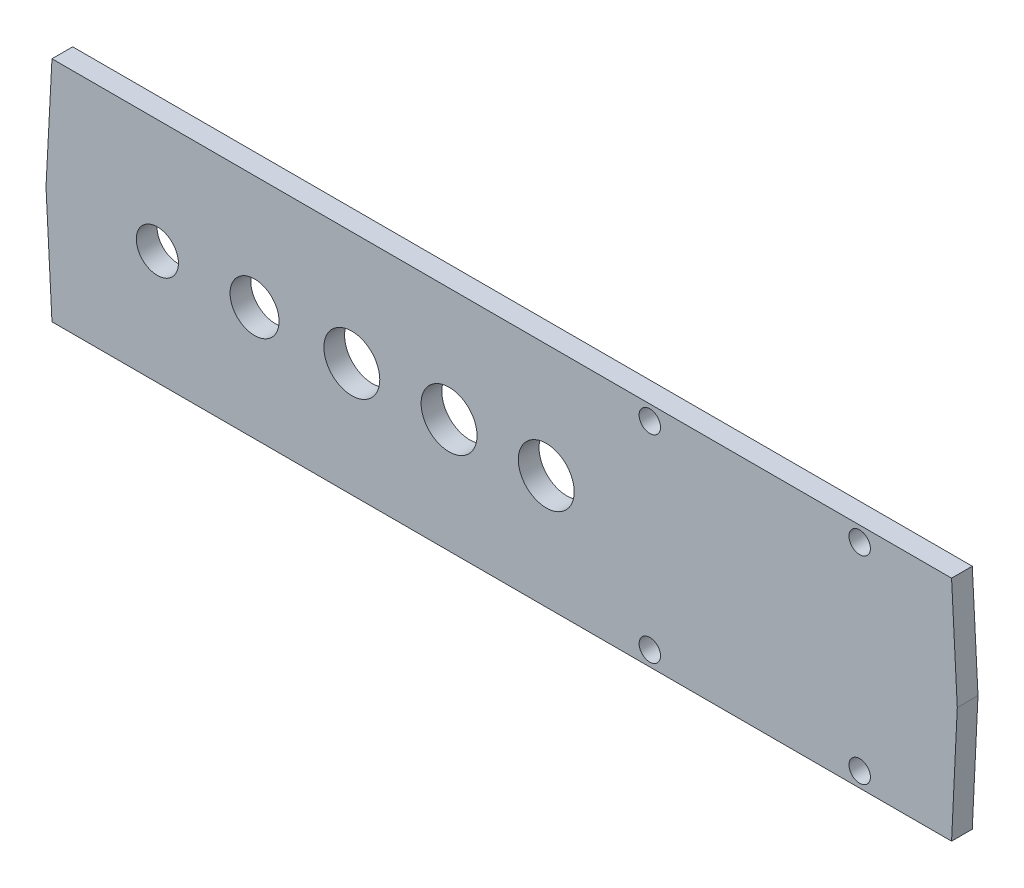
ISO-10303-21;
HEADER;
FILE_DESCRIPTION(('STEP AP214'),'2;1');
FILE_NAME('part.step','',(''),(''),'','','');
FILE_SCHEMA(('AUTOMOTIVE_DESIGN { 1 0 10303 214 1 1 1 1 }'));
ENDSEC;
DATA;
#1=APPLICATION_CONTEXT('core data for automotive mechanical design processes');
#2=APPLICATION_PROTOCOL_DEFINITION('international standard','automotive_design',2000,#1);
#3=PRODUCT_CONTEXT('',#1,'mechanical');
#4=PRODUCT('Part','Part','',(#3));
#5=PRODUCT_RELATED_PRODUCT_CATEGORY('part','',(#4));
#6=PRODUCT_DEFINITION_FORMATION('','',#4);
#7=PRODUCT_DEFINITION_CONTEXT('part definition',#1,'design');
#8=PRODUCT_DEFINITION('design','',#6,#7);
#9=PRODUCT_DEFINITION_SHAPE('','',#8);
#10=(LENGTH_UNIT() NAMED_UNIT(*) SI_UNIT(.MILLI.,.METRE.));
#11=(NAMED_UNIT(*) PLANE_ANGLE_UNIT() SI_UNIT($,.RADIAN.));
#12=(NAMED_UNIT(*) SI_UNIT($,.STERADIAN.) SOLID_ANGLE_UNIT());
#13=UNCERTAINTY_MEASURE_WITH_UNIT(LENGTH_MEASURE(1.E-05),#10,'distance_accuracy_value','');
#14=(GEOMETRIC_REPRESENTATION_CONTEXT(3) GLOBAL_UNCERTAINTY_ASSIGNED_CONTEXT((#13)) GLOBAL_UNIT_ASSIGNED_CONTEXT((#10,
#11,#12)) REPRESENTATION_CONTEXT('',''));
#15=CARTESIAN_POINT('',(0.,0.,0.));
#16=DIRECTION('',(0.,0.,1.));
#17=DIRECTION('',(1.,0.,0.));
#18=AXIS2_PLACEMENT_3D('',#15,#16,#17);
#19=CARTESIAN_POINT('',(0.,0.,3.));
#20=DIRECTION('',(0.998629534754574,-0.0523359562429475,0.));
#21=DIRECTION('',(0.0523359562429476,0.998629534754574,0.));
#22=AXIS2_PLACEMENT_3D('',#19,#20,#21);
#23=PLANE('',#22);
#24=DIRECTION('',(-0.0523359562429475,-0.998629534754574,0.));
#25=VECTOR('',#24,1.);
#26=CARTESIAN_POINT('',(0.,0.,0.));
#27=LINE('',#26,#25);
#28=CARTESIAN_POINT('',(0.,0.,0.));
#29=VERTEX_POINT('',#28);
#30=CARTESIAN_POINT('',(-0.864729170174011,-16.5000154939549,0.));
#31=VERTEX_POINT('',#30);
#32=EDGE_CURVE('E130',#29,#31,#27,.T.);
#33=ORIENTED_EDGE('',*,*,#32,.T.);
#34=DIRECTION('',(0.,0.,-1.));
#35=VECTOR('',#34,1.);
#36=CARTESIAN_POINT('',(-0.864729170174011,-16.5000154939549,3.));
#37=LINE('',#36,#35);
#38=CARTESIAN_POINT('',(-0.864729170174011,-16.5000154939549,3.));
#39=VERTEX_POINT('',#38);
#40=EDGE_CURVE('E11',#39,#31,#37,.T.);
#41=ORIENTED_EDGE('',*,*,#40,.F.);
#42=DIRECTION('',(-0.0523359562429475,-0.998629534754574,0.));
#43=VECTOR('',#42,1.);
#44=CARTESIAN_POINT('',(0.,0.,3.));
#45=LINE('',#44,#43);
#46=CARTESIAN_POINT('',(0.,0.,3.));
#47=VERTEX_POINT('',#46);
#48=EDGE_CURVE('E146',#47,#39,#45,.T.);
#49=ORIENTED_EDGE('',*,*,#48,.F.);
#50=DIRECTION('',(0.,0.,-1.));
#51=VECTOR('',#50,1.);
#52=CARTESIAN_POINT('',(0.,0.,3.));
#53=LINE('',#52,#51);
#54=EDGE_CURVE('E126',#47,#29,#53,.T.);
#55=ORIENTED_EDGE('',*,*,#54,.T.);
#56=EDGE_LOOP('',(#33,#41,#49,#55));
#57=FACE_BOUND('',#56,.T.);
#58=ADVANCED_FACE('F39',(#57),#23,.F.);
#59=CARTESIAN_POINT('',(0.,-33.0000309879097,3.));
#60=DIRECTION('',(0.998629534754574,0.0523359562429479,0.));
#61=DIRECTION('',(-0.0523359562429479,0.998629534754574,0.));
#62=AXIS2_PLACEMENT_3D('',#59,#60,#61);
#63=PLANE('',#62);
#64=DIRECTION('',(0.0523359562429479,-0.998629534754574,0.));
#65=VECTOR('',#64,1.);
#66=CARTESIAN_POINT('',(0.,-33.0000309879097,0.));
#67=LINE('',#66,#65);
#68=CARTESIAN_POINT('',(0.,-33.0000309879097,0.));
#69=VERTEX_POINT('',#68);
#70=EDGE_CURVE('E134',#31,#69,#67,.T.);
#71=ORIENTED_EDGE('',*,*,#70,.T.);
#72=DIRECTION('',(0.,0.,-1.));
#73=VECTOR('',#72,1.);
#74=CARTESIAN_POINT('',(0.,-33.0000309879097,3.));
#75=LINE('',#74,#73);
#76=CARTESIAN_POINT('',(0.,-33.0000309879097,3.));
#77=VERTEX_POINT('',#76);
#78=EDGE_CURVE('E49',#77,#69,#75,.T.);
#79=ORIENTED_EDGE('',*,*,#78,.F.);
#80=DIRECTION('',(0.0523359562429479,-0.998629534754574,0.));
#81=VECTOR('',#80,1.);
#82=CARTESIAN_POINT('',(0.,-33.0000309879097,3.));
#83=LINE('',#82,#81);
#84=EDGE_CURVE('E95',#39,#77,#83,.T.);
#85=ORIENTED_EDGE('',*,*,#84,.F.);
#86=ORIENTED_EDGE('',*,*,#40,.T.);
#87=EDGE_LOOP('',(#71,#79,#85,#86));
#88=FACE_BOUND('',#87,.T.);
#89=ADVANCED_FACE('F209',(#88),#63,.F.);
#90=CARTESIAN_POINT('',(130.305174389268,-32.9999924717593,3.));
#91=DIRECTION('',(-2.95584198131817E-07,0.999999999999956,0.));
#92=DIRECTION('',(-0.999999999999956,-2.95584198131817E-07,0.));
#93=AXIS2_PLACEMENT_3D('',#90,#91,#92);
#94=PLANE('',#93);
#95=DIRECTION('',(0.999999999999956,2.95584198131817E-07,0.));
#96=VECTOR('',#95,1.);
#97=CARTESIAN_POINT('',(130.305174389268,-32.9999924717593,0.));
#98=LINE('',#97,#96);
#99=CARTESIAN_POINT('',(130.305174389268,-32.9999924717593,0.));
#100=VERTEX_POINT('',#99);
#101=EDGE_CURVE('E137',#69,#100,#98,.T.);
#102=ORIENTED_EDGE('',*,*,#101,.T.);
#103=DIRECTION('',(0.,0.,-1.));
#104=VECTOR('',#103,1.);
#105=CARTESIAN_POINT('',(130.305174389268,-32.9999924717593,3.));
#106=LINE('',#105,#104);
#107=CARTESIAN_POINT('',(130.305174389268,-32.9999924717593,3.));
#108=VERTEX_POINT('',#107);
#109=EDGE_CURVE('E119',#108,#100,#106,.T.);
#110=ORIENTED_EDGE('',*,*,#109,.F.);
#111=DIRECTION('',(0.999999999999956,2.95584198131817E-07,0.));
#112=VECTOR('',#111,1.);
#113=CARTESIAN_POINT('',(130.305174389268,-32.9999924717593,3.));
#114=LINE('',#113,#112);
#115=EDGE_CURVE('E108',#77,#108,#114,.T.);
#116=ORIENTED_EDGE('',*,*,#115,.F.);
#117=ORIENTED_EDGE('',*,*,#78,.T.);
#118=EDGE_LOOP('',(#102,#110,#116,#117));
#119=FACE_BOUND('',#118,.T.);
#120=ADVANCED_FACE('F214',(#119),#94,.F.);
#121=CARTESIAN_POINT('',(130.305174389268,-32.9999924717593,3.));
#122=DIRECTION('',(-0.998839920851786,0.0481540498068133,0.));
#123=DIRECTION('',(-0.0481540498068133,-0.998839920851787,0.));
#124=AXIS2_PLACEMENT_3D('',#121,#122,#123);
#125=PLANE('',#124);
#126=DIRECTION('',(0.0481540498068133,0.998839920851787,0.));
#127=VECTOR('',#126,1.);
#128=CARTESIAN_POINT('',(130.305174389268,-32.9999924717593,0.));
#129=LINE('',#128,#127);
#130=CARTESIAN_POINT('',(131.133825839604,-15.8116115902375,0.));
#131=VERTEX_POINT('',#130);
#132=EDGE_CURVE('E117',#100,#131,#129,.T.);
#133=ORIENTED_EDGE('',*,*,#132,.T.);
#134=DIRECTION('',(0.,0.,-1.));
#135=VECTOR('',#134,1.);
#136=CARTESIAN_POINT('',(131.133825839604,-15.8116115902375,3.));
#137=LINE('',#136,#135);
#138=CARTESIAN_POINT('',(131.133825839604,-15.8116115902375,3.));
#139=VERTEX_POINT('',#138);
#140=EDGE_CURVE('E114',#139,#131,#137,.T.);
#141=ORIENTED_EDGE('',*,*,#140,.F.);
#142=DIRECTION('',(0.0481540498068133,0.998839920851787,0.));
#143=VECTOR('',#142,1.);
#144=CARTESIAN_POINT('',(130.305174389268,-32.9999924717593,3.));
#145=LINE('',#144,#143);
#146=EDGE_CURVE('E102',#108,#139,#145,.T.);
#147=ORIENTED_EDGE('',*,*,#146,.F.);
#148=ORIENTED_EDGE('',*,*,#109,.T.);
#149=EDGE_LOOP('',(#133,#141,#147,#148));
#150=FACE_BOUND('',#149,.T.);
#151=ADVANCED_FACE('F115',(#150),#125,.F.);
#152=CARTESIAN_POINT('',(130.305174389274,0.,3.));
#153=DIRECTION('',(-0.998629534754574,-0.0523359562429403,0.));
#154=DIRECTION('',(0.0523359562429403,-0.998629534754574,0.));
#155=AXIS2_PLACEMENT_3D('',#152,#153,#154);
#156=PLANE('',#155);
#157=DIRECTION('',(-0.0523359562429403,0.998629534754574,0.));
#158=VECTOR('',#157,1.);
#159=CARTESIAN_POINT('',(130.305174389274,0.,0.));
#160=LINE('',#159,#158);
#161=CARTESIAN_POINT('',(130.305174389274,0.,0.));
#162=VERTEX_POINT('',#161);
#163=EDGE_CURVE('E81',#131,#162,#160,.T.);
#164=ORIENTED_EDGE('',*,*,#163,.T.);
#165=DIRECTION('',(0.,0.,-1.));
#166=VECTOR('',#165,1.);
#167=CARTESIAN_POINT('',(130.305174389274,0.,3.));
#168=LINE('',#167,#166);
#169=CARTESIAN_POINT('',(130.305174389274,0.,3.));
#170=VERTEX_POINT('',#169);
#171=EDGE_CURVE('E120',#170,#162,#168,.T.);
#172=ORIENTED_EDGE('',*,*,#171,.F.);
#173=DIRECTION('',(-0.0523359562429403,0.998629534754574,0.));
#174=VECTOR('',#173,1.);
#175=CARTESIAN_POINT('',(130.305174389274,0.,3.));
#176=LINE('',#175,#174);
#177=EDGE_CURVE('E106',#139,#170,#176,.T.);
#178=ORIENTED_EDGE('',*,*,#177,.F.);
#179=ORIENTED_EDGE('',*,*,#140,.T.);
#180=EDGE_LOOP('',(#164,#172,#178,#179));
#181=FACE_BOUND('',#180,.T.);
#182=ADVANCED_FACE('F122',(#181),#156,.F.);
#183=CARTESIAN_POINT('',(0.,0.,3.));
#184=DIRECTION('',(0.,-1.,0.));
#185=DIRECTION('',(0.,0.,-1.));
#186=AXIS2_PLACEMENT_3D('',#183,#184,#185);
#187=PLANE('',#186);
#188=DIRECTION('',(-1.,0.,0.));
#189=VECTOR('',#188,1.);
#190=CARTESIAN_POINT('',(0.,0.,0.));
#191=LINE('',#190,#189);
#192=EDGE_CURVE('E87',#162,#29,#191,.T.);
#193=ORIENTED_EDGE('',*,*,#192,.T.);
#194=ORIENTED_EDGE('',*,*,#54,.F.);
#195=DIRECTION('',(-1.,0.,0.));
#196=VECTOR('',#195,1.);
#197=CARTESIAN_POINT('',(0.,0.,3.));
#198=LINE('',#197,#196);
#199=EDGE_CURVE('E58',#170,#47,#198,.T.);
#200=ORIENTED_EDGE('',*,*,#199,.F.);
#201=ORIENTED_EDGE('',*,*,#171,.T.);
#202=EDGE_LOOP('',(#193,#194,#200,#201));
#203=FACE_BOUND('',#202,.T.);
#204=ADVANCED_FACE('F267',(#203),#187,.F.);
#205=CARTESIAN_POINT('',(0.,0.,3.));
#206=DIRECTION('',(0.,0.,1.));
#207=DIRECTION('',(1.,0.,0.));
#208=AXIS2_PLACEMENT_3D('',#205,#206,#207);
#209=PLANE('',#208);
#210=CARTESIAN_POINT('',(86.59615234,-30.8412033,3.));
#211=DIRECTION('',(0.,0.,1.));
#212=DIRECTION('',(1.,0.,0.));
#213=AXIS2_PLACEMENT_3D('',#210,#211,#212);
#214=CIRCLE('',#213,1.54999999999999);
#215=CARTESIAN_POINT('',(88.14615234,-30.8412033,3.));
#216=VERTEX_POINT('',#215);
#217=EDGE_CURVE('E230',#216,#216,#214,.T.);
#218=ORIENTED_EDGE('',*,*,#217,.F.);
#219=EDGE_LOOP('',(#218));
#220=FACE_BOUND('',#219,.T.);
#221=CARTESIAN_POINT('',(71.5970454584895,-16.5000000010329,3.));
#222=DIRECTION('',(0.,0.,1.));
#223=DIRECTION('',(1.,0.,0.));
#224=AXIS2_PLACEMENT_3D('',#221,#222,#223);
#225=CIRCLE('',#224,4.05);
#226=CARTESIAN_POINT('',(75.6470454584895,-16.5000000010329,3.));
#227=VERTEX_POINT('',#226);
#228=EDGE_CURVE('E240',#227,#227,#225,.T.);
#229=ORIENTED_EDGE('',*,*,#228,.F.);
#230=EDGE_LOOP('',(#229));
#231=FACE_BOUND('',#230,.T.);
#232=CARTESIAN_POINT('',(57.5191519987785,-16.5000000010329,3.));
#233=DIRECTION('',(0.,0.,1.));
#234=DIRECTION('',(1.,0.,0.));
#235=AXIS2_PLACEMENT_3D('',#232,#233,#234);
#236=CIRCLE('',#235,4.05);
#237=CARTESIAN_POINT('',(61.5691519987785,-16.5000000010329,3.));
#238=VERTEX_POINT('',#237);
#239=EDGE_CURVE('E235',#238,#238,#236,.T.);
#240=ORIENTED_EDGE('',*,*,#239,.F.);
#241=EDGE_LOOP('',(#240));
#242=FACE_BOUND('',#241,.T.);
#243=CARTESIAN_POINT('',(43.4321990777949,-16.5000000010329,3.));
#244=DIRECTION('',(0.,0.,1.));
#245=DIRECTION('',(1.,0.,0.));
#246=AXIS2_PLACEMENT_3D('',#243,#244,#245);
#247=CIRCLE('',#246,4.05);
#248=CARTESIAN_POINT('',(47.4821990777949,-16.5000000010329,3.));
#249=VERTEX_POINT('',#248);
#250=EDGE_CURVE('E231',#249,#249,#247,.T.);
#251=ORIENTED_EDGE('',*,*,#250,.F.);
#252=EDGE_LOOP('',(#251));
#253=FACE_BOUND('',#252,.T.);
#254=CARTESIAN_POINT('',(29.3449157295901,-16.5000000010329,3.));
#255=DIRECTION('',(0.,0.,1.));
#256=DIRECTION('',(1.,0.,0.));
#257=AXIS2_PLACEMENT_3D('',#254,#255,#256);
#258=CIRCLE('',#257,3.55);
#259=CARTESIAN_POINT('',(32.8949157295901,-16.5000000010329,3.));
#260=VERTEX_POINT('',#259);
#261=EDGE_CURVE('E236',#260,#260,#258,.T.);
#262=ORIENTED_EDGE('',*,*,#261,.F.);
#263=EDGE_LOOP('',(#262));
#264=FACE_BOUND('',#263,.T.);
#265=CARTESIAN_POINT('',(15.264794979495,-16.5000000010329,3.));
#266=DIRECTION('',(0.,0.,1.));
#267=DIRECTION('',(1.,0.,0.));
#268=AXIS2_PLACEMENT_3D('',#265,#266,#267);
#269=CIRCLE('',#268,3.05);
#270=CARTESIAN_POINT('',(18.314794979495,-16.5000000010329,3.));
#271=VERTEX_POINT('',#270);
#272=EDGE_CURVE('E254',#271,#271,#269,.T.);
#273=ORIENTED_EDGE('',*,*,#272,.F.);
#274=EDGE_LOOP('',(#273));
#275=FACE_BOUND('',#274,.T.);
#276=CARTESIAN_POINT('',(116.99615234,-30.8412033,3.));
#277=DIRECTION('',(0.,0.,1.));
#278=DIRECTION('',(1.,0.,0.));
#279=AXIS2_PLACEMENT_3D('',#276,#277,#278);
#280=CIRCLE('',#279,1.54999999999999);
#281=CARTESIAN_POINT('',(118.54615234,-30.8412033,3.));
#282=VERTEX_POINT('',#281);
#283=EDGE_CURVE('E250',#282,#282,#280,.T.);
#284=ORIENTED_EDGE('',*,*,#283,.F.);
#285=EDGE_LOOP('',(#284));
#286=FACE_BOUND('',#285,.T.);
#287=CARTESIAN_POINT('',(86.59615234,-2.1587967,3.));
#288=DIRECTION('',(0.,0.,1.));
#289=DIRECTION('',(1.,0.,0.));
#290=AXIS2_PLACEMENT_3D('',#287,#288,#289);
#291=CIRCLE('',#290,1.54999999999999);
#292=CARTESIAN_POINT('',(88.14615234,-2.1587967,3.));
#293=VERTEX_POINT('',#292);
#294=EDGE_CURVE('E246',#293,#293,#291,.T.);
#295=ORIENTED_EDGE('',*,*,#294,.F.);
#296=EDGE_LOOP('',(#295));
#297=FACE_BOUND('',#296,.T.);
#298=CARTESIAN_POINT('',(116.99615234,-2.1587967,3.));
#299=DIRECTION('',(0.,0.,1.));
#300=DIRECTION('',(1.,0.,0.));
#301=AXIS2_PLACEMENT_3D('',#298,#299,#300);
#302=CIRCLE('',#301,1.54999999999999);
#303=CARTESIAN_POINT('',(118.54615234,-2.1587967,3.));
#304=VERTEX_POINT('',#303);
#305=EDGE_CURVE('E161',#304,#304,#302,.T.);
#306=ORIENTED_EDGE('',*,*,#305,.F.);
#307=EDGE_LOOP('',(#306));
#308=FACE_BOUND('',#307,.T.);
#309=ORIENTED_EDGE('',*,*,#48,.T.);
#310=ORIENTED_EDGE('',*,*,#84,.T.);
#311=ORIENTED_EDGE('',*,*,#115,.T.);
#312=ORIENTED_EDGE('',*,*,#146,.T.);
#313=ORIENTED_EDGE('',*,*,#177,.T.);
#314=ORIENTED_EDGE('',*,*,#199,.T.);
#315=EDGE_LOOP('',(#309,#310,#311,#312,#313,#314));
#316=FACE_BOUND('',#315,.T.);
#317=ADVANCED_FACE('F104',(#220,#231,#242,#253,#264,#275,#286,#297,#308,#316),#209,.T.);
#318=CARTESIAN_POINT('',(0.,0.,0.));
#319=DIRECTION('',(0.,0.,1.));
#320=DIRECTION('',(1.,0.,0.));
#321=AXIS2_PLACEMENT_3D('',#318,#319,#320);
#322=PLANE('',#321);
#323=CARTESIAN_POINT('',(86.59615234,-30.8412033,0.));
#324=DIRECTION('',(0.,0.,1.));
#325=DIRECTION('',(1.,0.,0.));
#326=AXIS2_PLACEMENT_3D('',#323,#324,#325);
#327=CIRCLE('',#326,1.54999999999999);
#328=CARTESIAN_POINT('',(88.14615234,-30.8412033,0.));
#329=VERTEX_POINT('',#328);
#330=EDGE_CURVE('E42',#329,#329,#327,.T.);
#331=ORIENTED_EDGE('',*,*,#330,.T.);
#332=EDGE_LOOP('',(#331));
#333=FACE_BOUND('',#332,.T.);
#334=CARTESIAN_POINT('',(71.5970454584895,-16.5000000010329,0.));
#335=DIRECTION('',(0.,0.,1.));
#336=DIRECTION('',(1.,0.,0.));
#337=AXIS2_PLACEMENT_3D('',#334,#335,#336);
#338=CIRCLE('',#337,4.05);
#339=CARTESIAN_POINT('',(75.6470454584895,-16.5000000010329,0.));
#340=VERTEX_POINT('',#339);
#341=EDGE_CURVE('E184',#340,#340,#338,.T.);
#342=ORIENTED_EDGE('',*,*,#341,.T.);
#343=EDGE_LOOP('',(#342));
#344=FACE_BOUND('',#343,.T.);
#345=CARTESIAN_POINT('',(57.5191519987785,-16.5000000010329,0.));
#346=DIRECTION('',(0.,0.,1.));
#347=DIRECTION('',(1.,0.,0.));
#348=AXIS2_PLACEMENT_3D('',#345,#346,#347);
#349=CIRCLE('',#348,4.05);
#350=CARTESIAN_POINT('',(61.5691519987785,-16.5000000010329,0.));
#351=VERTEX_POINT('',#350);
#352=EDGE_CURVE('E181',#351,#351,#349,.T.);
#353=ORIENTED_EDGE('',*,*,#352,.T.);
#354=EDGE_LOOP('',(#353));
#355=FACE_BOUND('',#354,.T.);
#356=CARTESIAN_POINT('',(43.4321990777949,-16.5000000010329,0.));
#357=DIRECTION('',(0.,0.,1.));
#358=DIRECTION('',(1.,0.,0.));
#359=AXIS2_PLACEMENT_3D('',#356,#357,#358);
#360=CIRCLE('',#359,4.05);
#361=CARTESIAN_POINT('',(47.4821990777949,-16.5000000010329,0.));
#362=VERTEX_POINT('',#361);
#363=EDGE_CURVE('E177',#362,#362,#360,.T.);
#364=ORIENTED_EDGE('',*,*,#363,.T.);
#365=EDGE_LOOP('',(#364));
#366=FACE_BOUND('',#365,.T.);
#367=CARTESIAN_POINT('',(29.3449157295901,-16.5000000010329,0.));
#368=DIRECTION('',(0.,0.,1.));
#369=DIRECTION('',(1.,0.,0.));
#370=AXIS2_PLACEMENT_3D('',#367,#368,#369);
#371=CIRCLE('',#370,3.55);
#372=CARTESIAN_POINT('',(32.8949157295901,-16.5000000010329,0.));
#373=VERTEX_POINT('',#372);
#374=EDGE_CURVE('E173',#373,#373,#371,.T.);
#375=ORIENTED_EDGE('',*,*,#374,.T.);
#376=EDGE_LOOP('',(#375));
#377=FACE_BOUND('',#376,.T.);
#378=CARTESIAN_POINT('',(15.264794979495,-16.5000000010329,0.));
#379=DIRECTION('',(0.,0.,1.));
#380=DIRECTION('',(1.,0.,0.));
#381=AXIS2_PLACEMENT_3D('',#378,#379,#380);
#382=CIRCLE('',#381,3.05);
#383=CARTESIAN_POINT('',(18.314794979495,-16.5000000010329,0.));
#384=VERTEX_POINT('',#383);
#385=EDGE_CURVE('E169',#384,#384,#382,.T.);
#386=ORIENTED_EDGE('',*,*,#385,.T.);
#387=EDGE_LOOP('',(#386));
#388=FACE_BOUND('',#387,.T.);
#389=CARTESIAN_POINT('',(116.99615234,-30.8412033,0.));
#390=DIRECTION('',(0.,0.,1.));
#391=DIRECTION('',(1.,0.,0.));
#392=AXIS2_PLACEMENT_3D('',#389,#390,#391);
#393=CIRCLE('',#392,1.54999999999999);
#394=CARTESIAN_POINT('',(118.54615234,-30.8412033,0.));
#395=VERTEX_POINT('',#394);
#396=EDGE_CURVE('E165',#395,#395,#393,.T.);
#397=ORIENTED_EDGE('',*,*,#396,.T.);
#398=EDGE_LOOP('',(#397));
#399=FACE_BOUND('',#398,.T.);
#400=CARTESIAN_POINT('',(86.59615234,-2.1587967,0.));
#401=DIRECTION('',(0.,0.,1.));
#402=DIRECTION('',(1.,0.,0.));
#403=AXIS2_PLACEMENT_3D('',#400,#401,#402);
#404=CIRCLE('',#403,1.54999999999999);
#405=CARTESIAN_POINT('',(88.14615234,-2.1587967,0.));
#406=VERTEX_POINT('',#405);
#407=EDGE_CURVE('E160',#406,#406,#404,.T.);
#408=ORIENTED_EDGE('',*,*,#407,.T.);
#409=EDGE_LOOP('',(#408));
#410=FACE_BOUND('',#409,.T.);
#411=CARTESIAN_POINT('',(116.99615234,-2.1587967,0.));
#412=DIRECTION('',(0.,0.,1.));
#413=DIRECTION('',(1.,0.,0.));
#414=AXIS2_PLACEMENT_3D('',#411,#412,#413);
#415=CIRCLE('',#414,1.54999999999999);
#416=CARTESIAN_POINT('',(118.54615234,-2.1587967,0.));
#417=VERTEX_POINT('',#416);
#418=EDGE_CURVE('E156',#417,#417,#415,.T.);
#419=ORIENTED_EDGE('',*,*,#418,.T.);
#420=EDGE_LOOP('',(#419));
#421=FACE_BOUND('',#420,.T.);
#422=ORIENTED_EDGE('',*,*,#32,.F.);
#423=ORIENTED_EDGE('',*,*,#192,.F.);
#424=ORIENTED_EDGE('',*,*,#163,.F.);
#425=ORIENTED_EDGE('',*,*,#132,.F.);
#426=ORIENTED_EDGE('',*,*,#101,.F.);
#427=ORIENTED_EDGE('',*,*,#70,.F.);
#428=EDGE_LOOP('',(#422,#423,#424,#425,#426,#427));
#429=FACE_BOUND('',#428,.T.);
#430=ADVANCED_FACE('F193',(#333,#344,#355,#366,#377,#388,#399,#410,#421,#429),#322,.F.);
#431=CARTESIAN_POINT('',(116.99615234,-2.1587967,-7.));
#432=DIRECTION('',(0.,0.,1.));
#433=DIRECTION('',(1.,0.,0.));
#434=AXIS2_PLACEMENT_3D('',#431,#432,#433);
#435=CYLINDRICAL_SURFACE('',#434,1.54999999999999);
#436=ORIENTED_EDGE('',*,*,#305,.T.);
#437=EDGE_LOOP('',(#436));
#438=FACE_BOUND('',#437,.T.);
#439=ORIENTED_EDGE('',*,*,#418,.F.);
#440=EDGE_LOOP('',(#439));
#441=FACE_BOUND('',#440,.T.);
#442=ADVANCED_FACE('F278',(#438,#441),#435,.F.);
#443=CARTESIAN_POINT('',(86.59615234,-2.1587967,-7.));
#444=DIRECTION('',(0.,0.,1.));
#445=DIRECTION('',(1.,0.,0.));
#446=AXIS2_PLACEMENT_3D('',#443,#444,#445);
#447=CYLINDRICAL_SURFACE('',#446,1.54999999999999);
#448=ORIENTED_EDGE('',*,*,#294,.T.);
#449=EDGE_LOOP('',(#448));
#450=FACE_BOUND('',#449,.T.);
#451=ORIENTED_EDGE('',*,*,#407,.F.);
#452=EDGE_LOOP('',(#451));
#453=FACE_BOUND('',#452,.T.);
#454=ADVANCED_FACE('F281',(#450,#453),#447,.F.);
#455=CARTESIAN_POINT('',(116.99615234,-30.8412033,-7.));
#456=DIRECTION('',(0.,0.,1.));
#457=DIRECTION('',(1.,0.,0.));
#458=AXIS2_PLACEMENT_3D('',#455,#456,#457);
#459=CYLINDRICAL_SURFACE('',#458,1.54999999999999);
#460=ORIENTED_EDGE('',*,*,#283,.T.);
#461=EDGE_LOOP('',(#460));
#462=FACE_BOUND('',#461,.T.);
#463=ORIENTED_EDGE('',*,*,#396,.F.);
#464=EDGE_LOOP('',(#463));
#465=FACE_BOUND('',#464,.T.);
#466=ADVANCED_FACE('F336',(#462,#465),#459,.F.);
#467=CARTESIAN_POINT('',(15.264794979495,-16.5000000010329,-7.));
#468=DIRECTION('',(0.,0.,1.));
#469=DIRECTION('',(1.,0.,0.));
#470=AXIS2_PLACEMENT_3D('',#467,#468,#469);
#471=CYLINDRICAL_SURFACE('',#470,3.05);
#472=ORIENTED_EDGE('',*,*,#272,.T.);
#473=EDGE_LOOP('',(#472));
#474=FACE_BOUND('',#473,.T.);
#475=ORIENTED_EDGE('',*,*,#385,.F.);
#476=EDGE_LOOP('',(#475));
#477=FACE_BOUND('',#476,.T.);
#478=ADVANCED_FACE('F345',(#474,#477),#471,.F.);
#479=CARTESIAN_POINT('',(29.3449157295901,-16.5000000010329,-7.));
#480=DIRECTION('',(0.,0.,1.));
#481=DIRECTION('',(1.,0.,0.));
#482=AXIS2_PLACEMENT_3D('',#479,#480,#481);
#483=CYLINDRICAL_SURFACE('',#482,3.55);
#484=ORIENTED_EDGE('',*,*,#261,.T.);
#485=EDGE_LOOP('',(#484));
#486=FACE_BOUND('',#485,.T.);
#487=ORIENTED_EDGE('',*,*,#374,.F.);
#488=EDGE_LOOP('',(#487));
#489=FACE_BOUND('',#488,.T.);
#490=ADVANCED_FACE('F262',(#486,#489),#483,.F.);
#491=CARTESIAN_POINT('',(43.4321990777949,-16.5000000010329,-7.));
#492=DIRECTION('',(0.,0.,1.));
#493=DIRECTION('',(1.,0.,0.));
#494=AXIS2_PLACEMENT_3D('',#491,#492,#493);
#495=CYLINDRICAL_SURFACE('',#494,4.05);
#496=ORIENTED_EDGE('',*,*,#250,.T.);
#497=EDGE_LOOP('',(#496));
#498=FACE_BOUND('',#497,.T.);
#499=ORIENTED_EDGE('',*,*,#363,.F.);
#500=EDGE_LOOP('',(#499));
#501=FACE_BOUND('',#500,.T.);
#502=ADVANCED_FACE('F364',(#498,#501),#495,.F.);
#503=CARTESIAN_POINT('',(57.5191519987785,-16.5000000010329,-7.));
#504=DIRECTION('',(0.,0.,1.));
#505=DIRECTION('',(1.,0.,0.));
#506=AXIS2_PLACEMENT_3D('',#503,#504,#505);
#507=CYLINDRICAL_SURFACE('',#506,4.05);
#508=ORIENTED_EDGE('',*,*,#239,.T.);
#509=EDGE_LOOP('',(#508));
#510=FACE_BOUND('',#509,.T.);
#511=ORIENTED_EDGE('',*,*,#352,.F.);
#512=EDGE_LOOP('',(#511));
#513=FACE_BOUND('',#512,.T.);
#514=ADVANCED_FACE('F203',(#510,#513),#507,.F.);
#515=CARTESIAN_POINT('',(71.5970454584895,-16.5000000010329,-7.));
#516=DIRECTION('',(0.,0.,1.));
#517=DIRECTION('',(1.,0.,0.));
#518=AXIS2_PLACEMENT_3D('',#515,#516,#517);
#519=CYLINDRICAL_SURFACE('',#518,4.05);
#520=ORIENTED_EDGE('',*,*,#228,.T.);
#521=EDGE_LOOP('',(#520));
#522=FACE_BOUND('',#521,.T.);
#523=ORIENTED_EDGE('',*,*,#341,.F.);
#524=EDGE_LOOP('',(#523));
#525=FACE_BOUND('',#524,.T.);
#526=ADVANCED_FACE('F197',(#522,#525),#519,.F.);
#527=CARTESIAN_POINT('',(86.59615234,-30.8412033,-7.));
#528=DIRECTION('',(0.,0.,1.));
#529=DIRECTION('',(1.,0.,0.));
#530=AXIS2_PLACEMENT_3D('',#527,#528,#529);
#531=CYLINDRICAL_SURFACE('',#530,1.54999999999999);
#532=ORIENTED_EDGE('',*,*,#217,.T.);
#533=EDGE_LOOP('',(#532));
#534=FACE_BOUND('',#533,.T.);
#535=ORIENTED_EDGE('',*,*,#330,.F.);
#536=EDGE_LOOP('',(#535));
#537=FACE_BOUND('',#536,.T.);
#538=ADVANCED_FACE('F195',(#534,#537),#531,.F.);
#539=CLOSED_SHELL('',(#58,#89,#120,#151,#182,#204,#317,#430,#442,#454,#466,#478,#490,#502,#514,
#526,#538));
#540=MANIFOLD_SOLID_BREP('B2',#539);
#541=ADVANCED_BREP_SHAPE_REPRESENTATION('',(#18,#540),#14);
#542=SHAPE_DEFINITION_REPRESENTATION(#9,#541);
ENDSEC;
END-ISO-10303-21;
